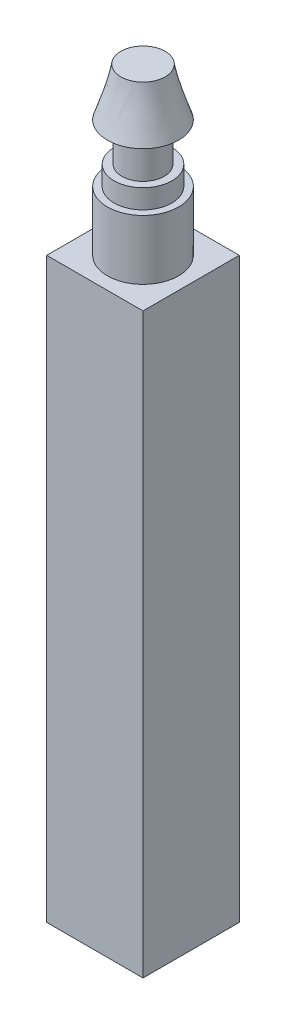
ISO-10303-21;
HEADER;
FILE_DESCRIPTION(('STEP AP214'),'2;1');
FILE_NAME('part.step','',(''),(''),'','','');
FILE_SCHEMA(('AUTOMOTIVE_DESIGN { 1 0 10303 214 1 1 1 1 }'));
ENDSEC;
DATA;
#1=APPLICATION_CONTEXT('core data for automotive mechanical design processes');
#2=APPLICATION_PROTOCOL_DEFINITION('international standard','automotive_design',2000,#1);
#3=PRODUCT_CONTEXT('',#1,'mechanical');
#4=PRODUCT('Part','Part','',(#3));
#5=PRODUCT_RELATED_PRODUCT_CATEGORY('part','',(#4));
#6=PRODUCT_DEFINITION_FORMATION('','',#4);
#7=PRODUCT_DEFINITION_CONTEXT('part definition',#1,'design');
#8=PRODUCT_DEFINITION('design','',#6,#7);
#9=PRODUCT_DEFINITION_SHAPE('','',#8);
#10=(LENGTH_UNIT() NAMED_UNIT(*) SI_UNIT(.MILLI.,.METRE.));
#11=(NAMED_UNIT(*) PLANE_ANGLE_UNIT() SI_UNIT($,.RADIAN.));
#12=(NAMED_UNIT(*) SI_UNIT($,.STERADIAN.) SOLID_ANGLE_UNIT());
#13=UNCERTAINTY_MEASURE_WITH_UNIT(LENGTH_MEASURE(1.E-05),#10,'distance_accuracy_value','');
#14=(GEOMETRIC_REPRESENTATION_CONTEXT(3) GLOBAL_UNCERTAINTY_ASSIGNED_CONTEXT((#13)) GLOBAL_UNIT_ASSIGNED_CONTEXT((#10,
#11,#12)) REPRESENTATION_CONTEXT('',''));
#15=CARTESIAN_POINT('',(0.,0.,0.));
#16=DIRECTION('',(0.,0.,1.));
#17=DIRECTION('',(1.,0.,0.));
#18=AXIS2_PLACEMENT_3D('',#15,#16,#17);
#19=CARTESIAN_POINT('',(0.,3.1,0.));
#20=DIRECTION('',(0.,-1.,0.));
#21=DIRECTION('',(0.,0.,-1.));
#22=AXIS2_PLACEMENT_3D('',#19,#20,#21);
#23=CYLINDRICAL_SURFACE('',#22,1.85);
#24=CARTESIAN_POINT('',(0.,3.1,0.));
#25=DIRECTION('',(0.,1.,0.));
#26=DIRECTION('',(0.,0.,1.));
#27=AXIS2_PLACEMENT_3D('',#24,#25,#26);
#28=CIRCLE('',#27,1.85);
#29=CARTESIAN_POINT('',(0.,3.1,-1.85));
#30=VERTEX_POINT('',#29);
#31=EDGE_CURVE('E174',#30,#30,#28,.T.);
#32=CARTESIAN_POINT('',(0.,0.,0.));
#33=DIRECTION('',(0.,1.,0.));
#34=DIRECTION('',(0.,0.,1.));
#35=AXIS2_PLACEMENT_3D('',#32,#33,#34);
#36=CIRCLE('',#35,1.85);
#37=CARTESIAN_POINT('',(0.,0.,-1.85));
#38=VERTEX_POINT('',#37);
#39=EDGE_CURVE('E41',#38,#38,#36,.T.);
#40=CARTESIAN_POINT('',(0.,3.1,-1.85));
#41=CARTESIAN_POINT('',(0.,3.06770833333333,-1.85));
#42=CARTESIAN_POINT('',(0.,3.03541666666667,-1.85));
#43=CARTESIAN_POINT('',(0.,2.97083333333333,-1.85));
#44=CARTESIAN_POINT('',(0.,2.93854166666667,-1.85));
#45=CARTESIAN_POINT('',(0.,2.87395833333333,-1.85));
#46=CARTESIAN_POINT('',(0.,2.84166666666667,-1.85));
#47=CARTESIAN_POINT('',(0.,2.77708333333333,-1.85));
#48=CARTESIAN_POINT('',(0.,2.74479166666667,-1.85));
#49=CARTESIAN_POINT('',(0.,2.68020833333333,-1.85));
#50=CARTESIAN_POINT('',(0.,2.64791666666667,-1.85));
#51=CARTESIAN_POINT('',(0.,2.58333333333333,-1.85));
#52=CARTESIAN_POINT('',(0.,2.55104166666667,-1.85));
#53=CARTESIAN_POINT('',(0.,2.48645833333333,-1.85));
#54=CARTESIAN_POINT('',(0.,2.45416666666667,-1.85));
#55=CARTESIAN_POINT('',(0.,2.38958333333333,-1.85));
#56=CARTESIAN_POINT('',(0.,2.35729166666667,-1.85));
#57=CARTESIAN_POINT('',(0.,2.29270833333333,-1.85));
#58=CARTESIAN_POINT('',(0.,2.26041666666667,-1.85));
#59=CARTESIAN_POINT('',(0.,2.19583333333333,-1.85));
#60=CARTESIAN_POINT('',(0.,2.16354166666667,-1.85));
#61=CARTESIAN_POINT('',(0.,2.09895833333333,-1.85));
#62=CARTESIAN_POINT('',(0.,2.06666666666667,-1.85));
#63=CARTESIAN_POINT('',(0.,2.00208333333333,-1.85));
#64=CARTESIAN_POINT('',(0.,1.96979166666667,-1.85));
#65=CARTESIAN_POINT('',(0.,1.90520833333333,-1.85));
#66=CARTESIAN_POINT('',(0.,1.87291666666667,-1.85));
#67=CARTESIAN_POINT('',(0.,1.80833333333333,-1.85));
#68=CARTESIAN_POINT('',(0.,1.77604166666667,-1.85));
#69=CARTESIAN_POINT('',(0.,1.71145833333333,-1.85));
#70=CARTESIAN_POINT('',(0.,1.67916666666667,-1.85));
#71=CARTESIAN_POINT('',(0.,1.61458333333333,-1.85));
#72=CARTESIAN_POINT('',(0.,1.58229166666667,-1.85));
#73=CARTESIAN_POINT('',(0.,1.51770833333333,-1.85));
#74=CARTESIAN_POINT('',(0.,1.48541666666667,-1.85));
#75=CARTESIAN_POINT('',(0.,1.42083333333333,-1.85));
#76=CARTESIAN_POINT('',(0.,1.38854166666667,-1.85));
#77=CARTESIAN_POINT('',(0.,1.32395833333333,-1.85));
#78=CARTESIAN_POINT('',(0.,1.29166666666667,-1.85));
#79=CARTESIAN_POINT('',(0.,1.22708333333333,-1.85));
#80=CARTESIAN_POINT('',(0.,1.19479166666667,-1.85));
#81=CARTESIAN_POINT('',(0.,1.13020833333333,-1.85));
#82=CARTESIAN_POINT('',(0.,1.09791666666667,-1.85));
#83=CARTESIAN_POINT('',(0.,1.03333333333333,-1.85));
#84=CARTESIAN_POINT('',(0.,1.00104166666667,-1.85));
#85=CARTESIAN_POINT('',(0.,0.936458333333333,-1.85));
#86=CARTESIAN_POINT('',(0.,0.904166666666667,-1.85));
#87=CARTESIAN_POINT('',(0.,0.839583333333333,-1.85));
#88=CARTESIAN_POINT('',(0.,0.807291666666667,-1.85));
#89=CARTESIAN_POINT('',(0.,0.742708333333333,-1.85));
#90=CARTESIAN_POINT('',(0.,0.710416666666667,-1.85));
#91=CARTESIAN_POINT('',(0.,0.645833333333333,-1.85));
#92=CARTESIAN_POINT('',(0.,0.613541666666667,-1.85));
#93=CARTESIAN_POINT('',(0.,0.548958333333333,-1.85));
#94=CARTESIAN_POINT('',(0.,0.516666666666667,-1.85));
#95=CARTESIAN_POINT('',(0.,0.452083333333333,-1.85));
#96=CARTESIAN_POINT('',(0.,0.419791666666667,-1.85));
#97=CARTESIAN_POINT('',(0.,0.355208333333333,-1.85));
#98=CARTESIAN_POINT('',(0.,0.322916666666667,-1.85));
#99=CARTESIAN_POINT('',(0.,0.258333333333333,-1.85));
#100=CARTESIAN_POINT('',(0.,0.226041666666667,-1.85));
#101=CARTESIAN_POINT('',(0.,0.161458333333333,-1.85));
#102=CARTESIAN_POINT('',(0.,0.129166666666667,-1.85));
#103=CARTESIAN_POINT('',(0.,0.0645833333333335,-1.85));
#104=CARTESIAN_POINT('',(0.,0.0322916666666667,-1.85));
#105=CARTESIAN_POINT('',(0.,0.,-1.85));
#106=B_SPLINE_CURVE_WITH_KNOTS('',3,(#40,#41,#42,#43,#44,#45,#46,#47,#48,#49,#50,#51,#52,#53,
#54,#55,#56,#57,#58,#59,#60,#61,#62,#63,#64,#65,#66,#67,#68,#69,#70,#71,#72,#73,#74,#75,#76,#77,
#78,#79,#80,#81,#82,#83,#84,#85,#86,#87,#88,#89,#90,#91,#92,#93,#94,#95,#96,#97,#98,#99,#100,
#101,#102,#103,#104,#105),.UNSPECIFIED.,.F.,.F.,(4,2,2,2,2,2,2,2,2,2,2,2,2,2,2,2,2,2,2,2,2,2,2,
2,2,2,2,2,2,2,2,2,4),(0.,0.0968749999999997,0.19375,0.290625,0.3875,0.484375,0.58125,0.678125,
0.775,0.871874999999999,0.96875,1.065625,1.1625,1.259375,1.35625,1.453125,1.55,1.646875,1.74375,
1.840625,1.9375,2.034375,2.13125,2.228125,2.325,2.421875,2.51875,2.615625,2.7125,2.809375,
2.90625,3.003125,3.1),.UNSPECIFIED.);
#107=EDGE_CURVE('BSEAM38',#30,#38,#106,.T.);
#108=ORIENTED_EDGE('',*,*,#31,.F.);
#109=ORIENTED_EDGE('',*,*,#39,.T.);
#110=ORIENTED_EDGE('',*,*,#107,.T.);
#111=ORIENTED_EDGE('',*,*,#107,.F.);
#112=EDGE_LOOP('',(#108,#110,#109,#111));
#113=FACE_BOUND('',#112,.T.);
#114=ADVANCED_FACE('F38',(#113),#23,.T.);
#115=CARTESIAN_POINT('',(0.,3.1,0.));
#116=DIRECTION('',(0.,1.,0.));
#117=DIRECTION('',(0.,0.,1.));
#118=AXIS2_PLACEMENT_3D('',#115,#116,#117);
#119=PLANE('',#118);
#120=CARTESIAN_POINT('',(0.,3.1,0.));
#121=DIRECTION('',(0.,1.,0.));
#122=DIRECTION('',(0.,0.,1.));
#123=AXIS2_PLACEMENT_3D('',#120,#121,#122);
#124=CIRCLE('',#123,1.5);
#125=CARTESIAN_POINT('',(0.,3.1,1.5));
#126=VERTEX_POINT('',#125);
#127=EDGE_CURVE('E47',#126,#126,#124,.T.);
#128=ORIENTED_EDGE('',*,*,#127,.F.);
#129=EDGE_LOOP('',(#128));
#130=FACE_BOUND('',#129,.T.);
#131=ORIENTED_EDGE('',*,*,#31,.T.);
#132=EDGE_LOOP('',(#131));
#133=FACE_BOUND('',#132,.T.);
#134=ADVANCED_FACE('F179',(#130,#133),#119,.T.);
#135=CARTESIAN_POINT('',(0.,4.1,0.));
#136=DIRECTION('',(0.,-1.,0.));
#137=DIRECTION('',(0.,0.,-1.));
#138=AXIS2_PLACEMENT_3D('',#135,#136,#137);
#139=CYLINDRICAL_SURFACE('',#138,1.5);
#140=CARTESIAN_POINT('',(0.,4.1,0.));
#141=DIRECTION('',(0.,1.,0.));
#142=DIRECTION('',(0.,0.,1.));
#143=AXIS2_PLACEMENT_3D('',#140,#141,#142);
#144=CIRCLE('',#143,1.5);
#145=CARTESIAN_POINT('',(0.,4.1,1.5));
#146=VERTEX_POINT('',#145);
#147=EDGE_CURVE('E170',#146,#146,#144,.T.);
#148=ORIENTED_EDGE('',*,*,#147,.F.);
#149=EDGE_LOOP('',(#148));
#150=FACE_BOUND('',#149,.T.);
#151=ORIENTED_EDGE('',*,*,#127,.T.);
#152=EDGE_LOOP('',(#151));
#153=FACE_BOUND('',#152,.T.);
#154=ADVANCED_FACE('F202',(#150,#153),#139,.T.);
#155=CARTESIAN_POINT('',(0.,4.1,0.));
#156=DIRECTION('',(0.,1.,0.));
#157=DIRECTION('',(0.,0.,1.));
#158=AXIS2_PLACEMENT_3D('',#155,#156,#157);
#159=PLANE('',#158);
#160=CARTESIAN_POINT('',(0.,4.1,0.));
#161=DIRECTION('',(0.,1.,0.));
#162=DIRECTION('',(0.,0.,1.));
#163=AXIS2_PLACEMENT_3D('',#160,#161,#162);
#164=CIRCLE('',#163,1.1);
#165=CARTESIAN_POINT('',(0.,4.1,1.1));
#166=VERTEX_POINT('',#165);
#167=EDGE_CURVE('E12',#166,#166,#164,.T.);
#168=ORIENTED_EDGE('',*,*,#167,.F.);
#169=EDGE_LOOP('',(#168));
#170=FACE_BOUND('',#169,.T.);
#171=ORIENTED_EDGE('',*,*,#147,.T.);
#172=EDGE_LOOP('',(#171));
#173=FACE_BOUND('',#172,.T.);
#174=ADVANCED_FACE('F197',(#170,#173),#159,.T.);
#175=CARTESIAN_POINT('',(0.,6.1,0.));
#176=DIRECTION('',(0.,-1.,0.));
#177=DIRECTION('',(0.,0.,-1.));
#178=AXIS2_PLACEMENT_3D('',#175,#176,#177);
#179=CYLINDRICAL_SURFACE('',#178,1.1);
#180=CARTESIAN_POINT('',(0.,6.1,0.));
#181=DIRECTION('',(0.,1.,0.));
#182=DIRECTION('',(0.,0.,1.));
#183=AXIS2_PLACEMENT_3D('',#180,#181,#182);
#184=CIRCLE('',#183,1.1);
#185=CARTESIAN_POINT('',(0.,6.1,1.1));
#186=VERTEX_POINT('',#185);
#187=EDGE_CURVE('E166',#186,#186,#184,.T.);
#188=ORIENTED_EDGE('',*,*,#187,.F.);
#189=EDGE_LOOP('',(#188));
#190=FACE_BOUND('',#189,.T.);
#191=ORIENTED_EDGE('',*,*,#167,.T.);
#192=EDGE_LOOP('',(#191));
#193=FACE_BOUND('',#192,.T.);
#194=ADVANCED_FACE('F153',(#190,#193),#179,.T.);
#195=CARTESIAN_POINT('',(0.,8.6,0.));
#196=DIRECTION('',(0.,1.,0.));
#197=DIRECTION('',(0.,0.,1.));
#198=AXIS2_PLACEMENT_3D('',#195,#196,#197);
#199=PLANE('',#198);
#200=CARTESIAN_POINT('',(0.,8.6,0.));
#201=DIRECTION('',(0.,1.,0.));
#202=DIRECTION('',(0.,0.,1.));
#203=AXIS2_PLACEMENT_3D('',#200,#201,#202);
#204=CIRCLE('',#203,1.15);
#205=CARTESIAN_POINT('',(0.620465420838555,8.6,0.968257538851949));
#206=VERTEX_POINT('',#205);
#207=EDGE_CURVE('E121',#206,#206,#204,.T.);
#208=ORIENTED_EDGE('',*,*,#207,.T.);
#209=EDGE_LOOP('',(#208));
#210=FACE_BOUND('',#209,.T.);
#211=ADVANCED_FACE('F144',(#210),#199,.T.);
#212=CARTESIAN_POINT('',(0.,6.1,0.));
#213=DIRECTION('',(0.,1.,0.));
#214=DIRECTION('',(0.,0.,1.));
#215=AXIS2_PLACEMENT_3D('',#212,#213,#214);
#216=PLANE('',#215);
#217=ORIENTED_EDGE('',*,*,#187,.T.);
#218=EDGE_LOOP('',(#217));
#219=FACE_BOUND('',#218,.T.);
#220=CARTESIAN_POINT('',(0.,6.1,0.));
#221=DIRECTION('',(0.,1.,0.));
#222=DIRECTION('',(0.,0.,1.));
#223=AXIS2_PLACEMENT_3D('',#220,#221,#222);
#224=CIRCLE('',#223,1.85);
#225=CARTESIAN_POINT('',(0.,6.1,1.85));
#226=VERTEX_POINT('',#225);
#227=EDGE_CURVE('E126',#226,#226,#224,.T.);
#228=ORIENTED_EDGE('',*,*,#227,.F.);
#229=EDGE_LOOP('',(#228));
#230=FACE_BOUND('',#229,.T.);
#231=ADVANCED_FACE('F141',(#219,#230),#216,.F.);
#232=CARTESIAN_POINT('',(0.,6.1,1.85));
#233=CARTESIAN_POINT('',(0.620465420838555,8.6,0.968257538851949));
#234=CARTESIAN_POINT('',(3.7,6.1,1.85));
#235=CARTESIAN_POINT('',(2.55698049854245,8.6,-0.272673302825161));
#236=CARTESIAN_POINT('',(3.7,6.1,-1.85));
#237=CARTESIAN_POINT('',(1.31604965686534,8.6,-2.20918838052906));
#238=CARTESIAN_POINT('',(0.,6.1,-1.85));
#239=CARTESIAN_POINT('',(-0.620465420838555,8.6,-0.96825753885195));
#240=CARTESIAN_POINT('',(-3.7,6.1,-1.85));
#241=CARTESIAN_POINT('',(-2.55698049854246,8.6,0.272673302825162));
#242=CARTESIAN_POINT('',(-3.7,6.1,1.85));
#243=CARTESIAN_POINT('',(-1.31604965686534,8.6,2.20918838052906));
#244=CARTESIAN_POINT('',(0.,6.1,1.85));
#245=CARTESIAN_POINT('',(0.620465420838555,8.6,0.968257538851949));
#246=(BOUNDED_SURFACE() B_SPLINE_SURFACE(3,1,((#232,#233),(#234,#235),(#236,#237),(#238,#239),
(#240,#241),(#242,#243),(#244,#245)),.UNSPECIFIED.,.T.,.F.,.F.) B_SPLINE_SURFACE_WITH_KNOTS((4,
3,4),(2,2),(0.,0.5,1.),(0.,1.),
.UNSPECIFIED.) GEOMETRIC_REPRESENTATION_ITEM() RATIONAL_B_SPLINE_SURFACE(((1.,1.),
(0.333333333333333,0.333333333333333),(0.333333333333333,0.333333333333333),(1.,1.),
(0.333333333333333,0.333333333333333),(0.333333333333333,0.333333333333333),(1.,1.))) REPRESENTATION_ITEM('') SURFACE());
#247=CARTESIAN_POINT('',(0.,6.1,1.85));
#248=CARTESIAN_POINT('',(0.00646318146706835,6.12604166666667,1.84081518269637));
#249=CARTESIAN_POINT('',(0.0129263629341366,6.15208333333333,1.83163036539275));
#250=CARTESIAN_POINT('',(0.0258527258682731,6.20416666666667,1.8132607307855));
#251=CARTESIAN_POINT('',(0.0323159073353414,6.23020833333333,1.80407591348187));
#252=CARTESIAN_POINT('',(0.045242270269478,6.28229166666667,1.78570627887462));
#253=CARTESIAN_POINT('',(0.0517054517365463,6.30833333333333,1.776521461571));
#254=CARTESIAN_POINT('',(0.0646318146706829,6.36041666666667,1.75815182696374));
#255=CARTESIAN_POINT('',(0.0710949961377511,6.38645833333333,1.74896700966012));
#256=CARTESIAN_POINT('',(0.0840213590718877,6.43854166666667,1.73059737505287));
#257=CARTESIAN_POINT('',(0.090484540538956,6.46458333333333,1.72141255774924));
#258=CARTESIAN_POINT('',(0.103410903473093,6.51666666666667,1.70304292314199));
#259=CARTESIAN_POINT('',(0.109874084940161,6.54270833333333,1.69385810583837));
#260=CARTESIAN_POINT('',(0.122800447874297,6.59479166666667,1.67548847123112));
#261=CARTESIAN_POINT('',(0.129263629341366,6.62083333333333,1.66630365392749));
#262=CARTESIAN_POINT('',(0.142189992275502,6.67291666666667,1.64793401932024));
#263=CARTESIAN_POINT('',(0.148653173742571,6.69895833333333,1.63874920201661));
#264=CARTESIAN_POINT('',(0.161579536676707,6.75104166666667,1.62037956740936));
#265=CARTESIAN_POINT('',(0.168042718143775,6.77708333333333,1.61119475010574));
#266=CARTESIAN_POINT('',(0.180969081077912,6.82916666666667,1.59282511549849));
#267=CARTESIAN_POINT('',(0.18743226254498,6.85520833333333,1.58364029819486));
#268=CARTESIAN_POINT('',(0.200358625479117,6.90729166666667,1.56527066358761));
#269=CARTESIAN_POINT('',(0.206821806946185,6.93333333333333,1.55608584628398));
#270=CARTESIAN_POINT('',(0.219748169880322,6.98541666666667,1.53771621167673));
#271=CARTESIAN_POINT('',(0.22621135134739,7.01145833333333,1.52853139437311));
#272=CARTESIAN_POINT('',(0.239137714281527,7.06354166666667,1.51016175976586));
#273=CARTESIAN_POINT('',(0.245600895748595,7.08958333333333,1.50097694246223));
#274=CARTESIAN_POINT('',(0.258527258682731,7.14166666666667,1.48260730785498));
#275=CARTESIAN_POINT('',(0.2649904401498,7.16770833333333,1.47342249055135));
#276=CARTESIAN_POINT('',(0.277916803083936,7.21979166666667,1.4550528559441));
#277=CARTESIAN_POINT('',(0.284379984551005,7.24583333333333,1.44586803864048));
#278=CARTESIAN_POINT('',(0.297306347485141,7.29791666666667,1.42749840403323));
#279=CARTESIAN_POINT('',(0.303769528952209,7.32395833333333,1.4183135867296));
#280=CARTESIAN_POINT('',(0.316695891886346,7.37604166666667,1.39994395212235));
#281=CARTESIAN_POINT('',(0.323159073353414,7.40208333333333,1.39075913481872));
#282=CARTESIAN_POINT('',(0.336085436287551,7.45416666666667,1.37238950021147));
#283=CARTESIAN_POINT('',(0.342548617754619,7.48020833333333,1.36320468290785));
#284=CARTESIAN_POINT('',(0.355474980688756,7.53229166666667,1.3448350483006));
#285=CARTESIAN_POINT('',(0.361938162155824,7.55833333333333,1.33565023099697));
#286=CARTESIAN_POINT('',(0.374864525089961,7.61041666666667,1.31728059638972));
#287=CARTESIAN_POINT('',(0.381327706557029,7.63645833333333,1.30809577908609));
#288=CARTESIAN_POINT('',(0.394254069491165,7.68854166666667,1.28972614447884));
#289=CARTESIAN_POINT('',(0.400717250958234,7.71458333333333,1.28054132717522));
#290=CARTESIAN_POINT('',(0.41364361389237,7.76666666666667,1.26217169256797));
#291=CARTESIAN_POINT('',(0.420106795359439,7.79270833333333,1.25298687526434));
#292=CARTESIAN_POINT('',(0.433033158293575,7.84479166666667,1.23461724065709));
#293=CARTESIAN_POINT('',(0.439496339760643,7.87083333333333,1.22543242335346));
#294=CARTESIAN_POINT('',(0.45242270269478,7.92291666666667,1.20706278874621));
#295=CARTESIAN_POINT('',(0.458885884161848,7.94895833333333,1.19787797144259));
#296=CARTESIAN_POINT('',(0.471812247095985,8.00104166666667,1.17950833683534));
#297=CARTESIAN_POINT('',(0.478275428563053,8.02708333333333,1.17032351953171));
#298=CARTESIAN_POINT('',(0.49120179149719,8.07916666666667,1.15195388492446));
#299=CARTESIAN_POINT('',(0.497664972964258,8.10520833333333,1.14276906762083));
#300=CARTESIAN_POINT('',(0.510591335898395,8.15729166666667,1.12439943301358));
#301=CARTESIAN_POINT('',(0.517054517365463,8.18333333333333,1.11521461570996));
#302=CARTESIAN_POINT('',(0.529980880299599,8.23541666666667,1.09684498110271));
#303=CARTESIAN_POINT('',(0.536444061766668,8.26145833333333,1.08766016379908));
#304=CARTESIAN_POINT('',(0.549370424700804,8.31354166666667,1.06929052919183));
#305=CARTESIAN_POINT('',(0.555833606167872,8.33958333333333,1.0601057118882));
#306=CARTESIAN_POINT('',(0.568759969102009,8.39166666666667,1.04173607728095));
#307=CARTESIAN_POINT('',(0.575223150569077,8.41770833333333,1.03255125997733));
#308=CARTESIAN_POINT('',(0.588149513503214,8.46979166666667,1.01418162537008));
#309=CARTESIAN_POINT('',(0.594612694970282,8.49583333333333,1.00499680806645));
#310=CARTESIAN_POINT('',(0.607539057904419,8.54791666666667,0.9866271734592));
#311=CARTESIAN_POINT('',(0.614002239371487,8.57395833333333,0.977442356155575));
#312=CARTESIAN_POINT('',(0.620465420838555,8.6,0.968257538851949));
#313=B_SPLINE_CURVE_WITH_KNOTS('',3,(#247,#248,#249,#250,#251,#252,#253,#254,#255,#256,#257,
#258,#259,#260,#261,#262,#263,#264,#265,#266,#267,#268,#269,#270,#271,#272,#273,#274,#275,#276,
#277,#278,#279,#280,#281,#282,#283,#284,#285,#286,#287,#288,#289,#290,#291,#292,#293,#294,#295,
#296,#297,#298,#299,#300,#301,#302,#303,#304,#305,#306,#307,#308,#309,#310,#311,#312),
.UNSPECIFIED.,.F.,.F.,(4,2,2,2,2,2,2,2,2,2,2,2,2,2,2,2,2,2,2,2,2,2,2,2,2,2,2,2,2,2,2,2,4),(0.,
0.0850806551290898,0.17016131025818,0.255241965387269,0.340322620516359,0.425403275645449,
0.510483930774539,0.595564585903629,0.680645241032718,0.765725896161807,0.850806551290897,
0.935887206419988,1.02096786154908,1.10604851667817,1.19112917180726,1.27620982693635,
1.36129048206544,1.44637113719453,1.53145179232361,1.6165324474527,1.70161310258179,
1.78669375771088,1.87177441283997,1.95685506796906,2.04193572309815,2.12701637822724,
2.21209703335633,2.29717768848542,2.38225834361451,2.4673389987436,2.55241965387269,
2.63750030900178,2.72258096413087),.UNSPECIFIED.);
#314=EDGE_CURVE('BSEAM128',#226,#206,#313,.T.);
#315=ORIENTED_EDGE('',*,*,#227,.T.);
#316=ORIENTED_EDGE('',*,*,#207,.F.);
#317=ORIENTED_EDGE('',*,*,#314,.T.);
#318=ORIENTED_EDGE('',*,*,#314,.F.);
#319=EDGE_LOOP('',(#315,#317,#316,#318));
#320=FACE_BOUND('',#319,.T.);
#321=ADVANCED_FACE('F128',(#320),#246,.T.);
#322=CARTESIAN_POINT('',(2.5,-30.,2.5));
#323=DIRECTION('',(-1.,0.,0.));
#324=DIRECTION('',(0.,0.,1.));
#325=AXIS2_PLACEMENT_3D('',#322,#323,#324);
#326=PLANE('',#325);
#327=DIRECTION('',(0.,0.,1.));
#328=VECTOR('',#327,1.);
#329=CARTESIAN_POINT('',(2.5,0.,2.5));
#330=LINE('',#329,#328);
#331=CARTESIAN_POINT('',(2.5,0.,-2.5));
#332=VERTEX_POINT('',#331);
#333=CARTESIAN_POINT('',(2.5,0.,2.5));
#334=VERTEX_POINT('',#333);
#335=EDGE_CURVE('E107',#332,#334,#330,.T.);
#336=ORIENTED_EDGE('',*,*,#335,.T.);
#337=DIRECTION('',(0.,1.,0.));
#338=VECTOR('',#337,1.);
#339=CARTESIAN_POINT('',(2.5,-30.,2.5));
#340=LINE('',#339,#338);
#341=CARTESIAN_POINT('',(2.5,-30.,2.5));
#342=VERTEX_POINT('',#341);
#343=EDGE_CURVE('E98',#342,#334,#340,.T.);
#344=ORIENTED_EDGE('',*,*,#343,.F.);
#345=DIRECTION('',(0.,0.,1.));
#346=VECTOR('',#345,1.);
#347=CARTESIAN_POINT('',(2.5,-30.,2.5));
#348=LINE('',#347,#346);
#349=CARTESIAN_POINT('',(2.5,-30.,-2.5));
#350=VERTEX_POINT('',#349);
#351=EDGE_CURVE('E92',#350,#342,#348,.T.);
#352=ORIENTED_EDGE('',*,*,#351,.F.);
#353=DIRECTION('',(0.,1.,0.));
#354=VECTOR('',#353,1.);
#355=CARTESIAN_POINT('',(2.5,-30.,-2.5));
#356=LINE('',#355,#354);
#357=EDGE_CURVE('E103',#350,#332,#356,.T.);
#358=ORIENTED_EDGE('',*,*,#357,.T.);
#359=EDGE_LOOP('',(#336,#344,#352,#358));
#360=FACE_BOUND('',#359,.T.);
#361=ADVANCED_FACE('F140',(#360),#326,.F.);
#362=CARTESIAN_POINT('',(-2.5,-30.,2.5));
#363=DIRECTION('',(0.,0.,-1.));
#364=DIRECTION('',(-1.,0.,0.));
#365=AXIS2_PLACEMENT_3D('',#362,#363,#364);
#366=PLANE('',#365);
#367=DIRECTION('',(-1.,0.,0.));
#368=VECTOR('',#367,1.);
#369=CARTESIAN_POINT('',(-2.5,0.,2.5));
#370=LINE('',#369,#368);
#371=CARTESIAN_POINT('',(-2.5,0.,2.5));
#372=VERTEX_POINT('',#371);
#373=EDGE_CURVE('E97',#334,#372,#370,.T.);
#374=ORIENTED_EDGE('',*,*,#373,.T.);
#375=DIRECTION('',(0.,1.,0.));
#376=VECTOR('',#375,1.);
#377=CARTESIAN_POINT('',(-2.5,-30.,2.5));
#378=LINE('',#377,#376);
#379=CARTESIAN_POINT('',(-2.5,-30.,2.5));
#380=VERTEX_POINT('',#379);
#381=EDGE_CURVE('E95',#380,#372,#378,.T.);
#382=ORIENTED_EDGE('',*,*,#381,.F.);
#383=DIRECTION('',(-1.,0.,0.));
#384=VECTOR('',#383,1.);
#385=CARTESIAN_POINT('',(-2.5,-30.,2.5));
#386=LINE('',#385,#384);
#387=EDGE_CURVE('E87',#342,#380,#386,.T.);
#388=ORIENTED_EDGE('',*,*,#387,.F.);
#389=ORIENTED_EDGE('',*,*,#343,.T.);
#390=EDGE_LOOP('',(#374,#382,#388,#389));
#391=FACE_BOUND('',#390,.T.);
#392=ADVANCED_FACE('F96',(#391),#366,.F.);
#393=CARTESIAN_POINT('',(-2.5,-30.,2.5));
#394=DIRECTION('',(1.,0.,0.));
#395=DIRECTION('',(0.,0.,-1.));
#396=AXIS2_PLACEMENT_3D('',#393,#394,#395);
#397=PLANE('',#396);
#398=DIRECTION('',(0.,0.,-1.));
#399=VECTOR('',#398,1.);
#400=CARTESIAN_POINT('',(-2.5,0.,2.5));
#401=LINE('',#400,#399);
#402=CARTESIAN_POINT('',(-2.5,0.,-2.5));
#403=VERTEX_POINT('',#402);
#404=EDGE_CURVE('E73',#372,#403,#401,.T.);
#405=ORIENTED_EDGE('',*,*,#404,.T.);
#406=DIRECTION('',(0.,1.,0.));
#407=VECTOR('',#406,1.);
#408=CARTESIAN_POINT('',(-2.5,-30.,-2.5));
#409=LINE('',#408,#407);
#410=CARTESIAN_POINT('',(-2.5,-30.,-2.5));
#411=VERTEX_POINT('',#410);
#412=EDGE_CURVE('E99',#411,#403,#409,.T.);
#413=ORIENTED_EDGE('',*,*,#412,.F.);
#414=DIRECTION('',(0.,0.,-1.));
#415=VECTOR('',#414,1.);
#416=CARTESIAN_POINT('',(-2.5,-30.,2.5));
#417=LINE('',#416,#415);
#418=EDGE_CURVE('E90',#380,#411,#417,.T.);
#419=ORIENTED_EDGE('',*,*,#418,.F.);
#420=ORIENTED_EDGE('',*,*,#381,.T.);
#421=EDGE_LOOP('',(#405,#413,#419,#420));
#422=FACE_BOUND('',#421,.T.);
#423=ADVANCED_FACE('F101',(#422),#397,.F.);
#424=CARTESIAN_POINT('',(-2.5,-30.,-2.5));
#425=DIRECTION('',(0.,0.,1.));
#426=DIRECTION('',(1.,0.,0.));
#427=AXIS2_PLACEMENT_3D('',#424,#425,#426);
#428=PLANE('',#427);
#429=DIRECTION('',(1.,0.,0.));
#430=VECTOR('',#429,1.);
#431=CARTESIAN_POINT('',(-2.5,0.,-2.5));
#432=LINE('',#431,#430);
#433=EDGE_CURVE('E79',#403,#332,#432,.T.);
#434=ORIENTED_EDGE('',*,*,#433,.T.);
#435=ORIENTED_EDGE('',*,*,#357,.F.);
#436=DIRECTION('',(1.,0.,0.));
#437=VECTOR('',#436,1.);
#438=CARTESIAN_POINT('',(-2.5,-30.,-2.5));
#439=LINE('',#438,#437);
#440=EDGE_CURVE('E56',#411,#350,#439,.T.);
#441=ORIENTED_EDGE('',*,*,#440,.F.);
#442=ORIENTED_EDGE('',*,*,#412,.T.);
#443=EDGE_LOOP('',(#434,#435,#441,#442));
#444=FACE_BOUND('',#443,.T.);
#445=ADVANCED_FACE('F266',(#444),#428,.F.);
#446=CARTESIAN_POINT('',(0.,-30.,0.));
#447=DIRECTION('',(0.,-1.,0.));
#448=DIRECTION('',(0.,0.,-1.));
#449=AXIS2_PLACEMENT_3D('',#446,#447,#448);
#450=PLANE('',#449);
#451=CARTESIAN_POINT('',(0.,-30.,0.));
#452=DIRECTION('',(0.,-1.,0.));
#453=DIRECTION('',(0.,0.,-1.));
#454=AXIS2_PLACEMENT_3D('',#451,#452,#453);
#455=CIRCLE('',#454,1.);
#456=CARTESIAN_POINT('',(0.,-30.,-1.));
#457=VERTEX_POINT('',#456);
#458=EDGE_CURVE('E318',#457,#457,#455,.T.);
#459=ORIENTED_EDGE('',*,*,#458,.F.);
#460=EDGE_LOOP('',(#459));
#461=FACE_BOUND('',#460,.T.);
#462=ORIENTED_EDGE('',*,*,#351,.T.);
#463=ORIENTED_EDGE('',*,*,#387,.T.);
#464=ORIENTED_EDGE('',*,*,#418,.T.);
#465=ORIENTED_EDGE('',*,*,#440,.T.);
#466=EDGE_LOOP('',(#462,#463,#464,#465));
#467=FACE_BOUND('',#466,.T.);
#468=ADVANCED_FACE('F88',(#461,#467),#450,.T.);
#469=CARTESIAN_POINT('',(0.,0.,0.));
#470=DIRECTION('',(0.,-1.,0.));
#471=DIRECTION('',(0.,0.,-1.));
#472=AXIS2_PLACEMENT_3D('',#469,#470,#471);
#473=PLANE('',#472);
#474=ORIENTED_EDGE('',*,*,#39,.F.);
#475=EDGE_LOOP('',(#474));
#476=FACE_BOUND('',#475,.T.);
#477=ORIENTED_EDGE('',*,*,#335,.F.);
#478=ORIENTED_EDGE('',*,*,#433,.F.);
#479=ORIENTED_EDGE('',*,*,#404,.F.);
#480=ORIENTED_EDGE('',*,*,#373,.F.);
#481=EDGE_LOOP('',(#477,#478,#479,#480));
#482=FACE_BOUND('',#481,.T.);
#483=ADVANCED_FACE('F281',(#476,#482),#473,.F.);
#484=CARTESIAN_POINT('',(0.,-5.99999999999998,0.));
#485=DIRECTION('',(0.,-1.,0.));
#486=DIRECTION('',(0.,0.,-1.));
#487=AXIS2_PLACEMENT_3D('',#484,#485,#486);
#488=CYLINDRICAL_SURFACE('',#487,1.);
#489=CARTESIAN_POINT('',(0.,-5.99999999999998,0.));
#490=DIRECTION('',(0.,-1.,0.));
#491=DIRECTION('',(0.,0.,-1.));
#492=AXIS2_PLACEMENT_3D('',#489,#490,#491);
#493=CIRCLE('',#492,1.);
#494=CARTESIAN_POINT('',(0.,-5.99999999999998,-1.));
#495=VERTEX_POINT('',#494);
#496=EDGE_CURVE('E110',#495,#495,#493,.T.);
#497=ORIENTED_EDGE('',*,*,#496,.F.);
#498=EDGE_LOOP('',(#497));
#499=FACE_BOUND('',#498,.T.);
#500=ORIENTED_EDGE('',*,*,#458,.T.);
#501=EDGE_LOOP('',(#500));
#502=FACE_BOUND('',#501,.T.);
#503=ADVANCED_FACE('F286',(#499,#502),#488,.F.);
#504=CARTESIAN_POINT('',(0.,-5.99999999999998,0.));
#505=DIRECTION('',(0.,-1.,0.));
#506=DIRECTION('',(0.,0.,-1.));
#507=AXIS2_PLACEMENT_3D('',#504,#505,#506);
#508=PLANE('',#507);
#509=ORIENTED_EDGE('',*,*,#496,.T.);
#510=EDGE_LOOP('',(#509));
#511=FACE_BOUND('',#510,.T.);
#512=ADVANCED_FACE('F302',(#511),#508,.T.);
#513=CLOSED_SHELL('',(#114,#134,#154,#174,#194,#211,#231,#321,#361,#392,#423,#445,#468,#483,
#503,#512));
#514=MANIFOLD_SOLID_BREP('B2',#513);
#515=ADVANCED_BREP_SHAPE_REPRESENTATION('',(#18,#514),#14);
#516=SHAPE_DEFINITION_REPRESENTATION(#9,#515);
ENDSEC;
END-ISO-10303-21;
